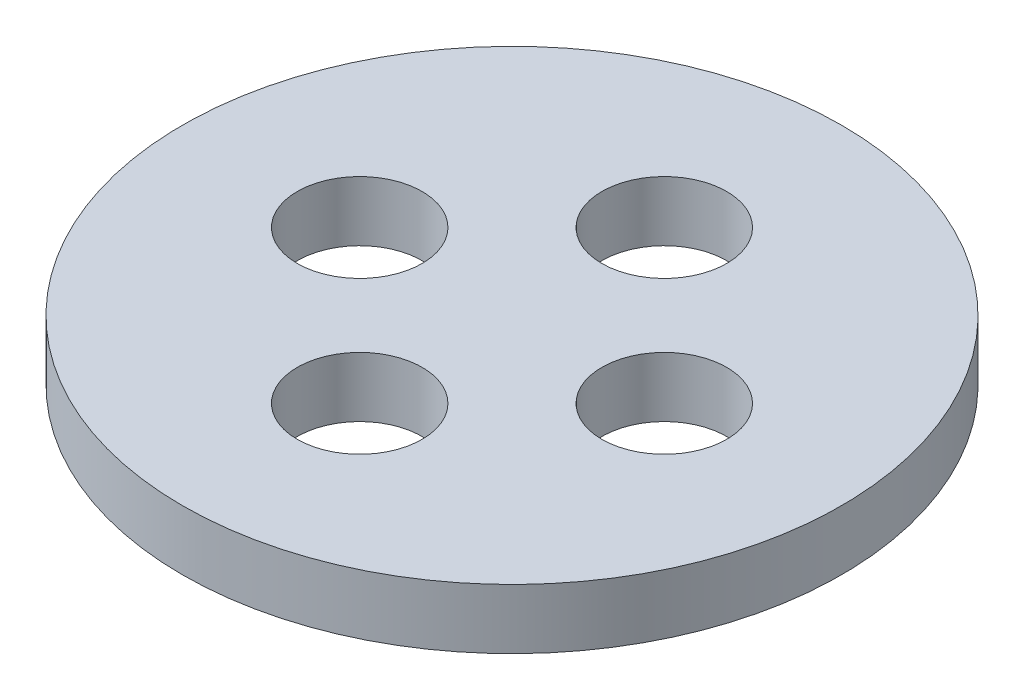
ISO-10303-21;
HEADER;
FILE_DESCRIPTION(('STEP AP214'),'2;1');
FILE_NAME('part.step','',(''),(''),'','','');
FILE_SCHEMA(('AUTOMOTIVE_DESIGN { 1 0 10303 214 1 1 1 1 }'));
ENDSEC;
DATA;
#1=APPLICATION_CONTEXT('core data for automotive mechanical design processes');
#2=APPLICATION_PROTOCOL_DEFINITION('international standard','automotive_design',2000,#1);
#3=PRODUCT_CONTEXT('',#1,'mechanical');
#4=PRODUCT('Part','Part','',(#3));
#5=PRODUCT_RELATED_PRODUCT_CATEGORY('part','',(#4));
#6=PRODUCT_DEFINITION_FORMATION('','',#4);
#7=PRODUCT_DEFINITION_CONTEXT('part definition',#1,'design');
#8=PRODUCT_DEFINITION('design','',#6,#7);
#9=PRODUCT_DEFINITION_SHAPE('','',#8);
#10=(LENGTH_UNIT() NAMED_UNIT(*) SI_UNIT(.MILLI.,.METRE.));
#11=(NAMED_UNIT(*) PLANE_ANGLE_UNIT() SI_UNIT($,.RADIAN.));
#12=(NAMED_UNIT(*) SI_UNIT($,.STERADIAN.) SOLID_ANGLE_UNIT());
#13=UNCERTAINTY_MEASURE_WITH_UNIT(LENGTH_MEASURE(1.E-05),#10,'distance_accuracy_value','');
#14=(GEOMETRIC_REPRESENTATION_CONTEXT(3) GLOBAL_UNCERTAINTY_ASSIGNED_CONTEXT((#13)) GLOBAL_UNIT_ASSIGNED_CONTEXT((#10,
#11,#12)) REPRESENTATION_CONTEXT('',''));
#15=CARTESIAN_POINT('',(0.,0.,0.));
#16=DIRECTION('',(0.,0.,1.));
#17=DIRECTION('',(1.,0.,0.));
#18=AXIS2_PLACEMENT_3D('',#15,#16,#17);
#19=CARTESIAN_POINT('',(0.,12.,0.));
#20=DIRECTION('',(0.,1.,0.));
#21=DIRECTION('',(0.,0.,1.));
#22=AXIS2_PLACEMENT_3D('',#19,#20,#21);
#23=PLANE('',#22);
#24=CARTESIAN_POINT('',(0.,12.,30.5));
#25=DIRECTION('',(0.,1.,0.));
#26=DIRECTION('',(0.,0.,1.));
#27=AXIS2_PLACEMENT_3D('',#24,#25,#26);
#28=CIRCLE('',#27,12.5);
#29=CARTESIAN_POINT('',(0.,12.,43.));
#30=VERTEX_POINT('',#29);
#31=EDGE_CURVE('E53',#30,#30,#28,.T.);
#32=ORIENTED_EDGE('',*,*,#31,.F.);
#33=EDGE_LOOP('',(#32));
#34=FACE_BOUND('',#33,.T.);
#35=CARTESIAN_POINT('',(0.,12.,-30.5));
#36=DIRECTION('',(0.,1.,0.));
#37=DIRECTION('',(0.,0.,1.));
#38=AXIS2_PLACEMENT_3D('',#35,#36,#37);
#39=CIRCLE('',#38,12.5);
#40=CARTESIAN_POINT('',(0.,12.,-18.));
#41=VERTEX_POINT('',#40);
#42=EDGE_CURVE('E42',#41,#41,#39,.T.);
#43=ORIENTED_EDGE('',*,*,#42,.F.);
#44=EDGE_LOOP('',(#43));
#45=FACE_BOUND('',#44,.T.);
#46=CARTESIAN_POINT('',(0.,12.,0.));
#47=DIRECTION('',(0.,1.,0.));
#48=DIRECTION('',(0.,0.,1.));
#49=AXIS2_PLACEMENT_3D('',#46,#47,#48);
#50=CIRCLE('',#49,66.);
#51=CARTESIAN_POINT('',(0.,12.,66.));
#52=VERTEX_POINT('',#51);
#53=EDGE_CURVE('E10',#52,#52,#50,.T.);
#54=ORIENTED_EDGE('',*,*,#53,.T.);
#55=EDGE_LOOP('',(#54));
#56=FACE_BOUND('',#55,.T.);
#57=CARTESIAN_POINT('',(30.5,12.,0.));
#58=DIRECTION('',(0.,1.,0.));
#59=DIRECTION('',(0.,0.,1.));
#60=AXIS2_PLACEMENT_3D('',#57,#58,#59);
#61=CIRCLE('',#60,12.5);
#62=CARTESIAN_POINT('',(30.5,12.,12.5));
#63=VERTEX_POINT('',#62);
#64=EDGE_CURVE('E47',#63,#63,#61,.T.);
#65=ORIENTED_EDGE('',*,*,#64,.F.);
#66=EDGE_LOOP('',(#65));
#67=FACE_BOUND('',#66,.T.);
#68=CARTESIAN_POINT('',(-30.5,12.,0.));
#69=DIRECTION('',(0.,1.,0.));
#70=DIRECTION('',(0.,0.,1.));
#71=AXIS2_PLACEMENT_3D('',#68,#69,#70);
#72=CIRCLE('',#71,12.5);
#73=CARTESIAN_POINT('',(-30.5,12.,12.5));
#74=VERTEX_POINT('',#73);
#75=EDGE_CURVE('E59',#74,#74,#72,.T.);
#76=ORIENTED_EDGE('',*,*,#75,.F.);
#77=EDGE_LOOP('',(#76));
#78=FACE_BOUND('',#77,.T.);
#79=ADVANCED_FACE('F31',(#34,#45,#56,#67,#78),#23,.T.);
#80=CARTESIAN_POINT('',(0.,0.,0.));
#81=DIRECTION('',(0.,1.,0.));
#82=DIRECTION('',(0.,0.,1.));
#83=AXIS2_PLACEMENT_3D('',#80,#81,#82);
#84=PLANE('',#83);
#85=CARTESIAN_POINT('',(0.,0.,30.5));
#86=DIRECTION('',(0.,1.,0.));
#87=DIRECTION('',(0.,0.,1.));
#88=AXIS2_PLACEMENT_3D('',#85,#86,#87);
#89=CIRCLE('',#88,12.5);
#90=CARTESIAN_POINT('',(0.,0.,43.));
#91=VERTEX_POINT('',#90);
#92=EDGE_CURVE('E56',#91,#91,#89,.T.);
#93=ORIENTED_EDGE('',*,*,#92,.T.);
#94=EDGE_LOOP('',(#93));
#95=FACE_BOUND('',#94,.T.);
#96=CARTESIAN_POINT('',(0.,0.,-30.5));
#97=DIRECTION('',(0.,1.,0.));
#98=DIRECTION('',(0.,0.,1.));
#99=AXIS2_PLACEMENT_3D('',#96,#97,#98);
#100=CIRCLE('',#99,12.5);
#101=CARTESIAN_POINT('',(0.,0.,-18.));
#102=VERTEX_POINT('',#101);
#103=EDGE_CURVE('E44',#102,#102,#100,.T.);
#104=ORIENTED_EDGE('',*,*,#103,.T.);
#105=EDGE_LOOP('',(#104));
#106=FACE_BOUND('',#105,.T.);
#107=CARTESIAN_POINT('',(0.,0.,0.));
#108=DIRECTION('',(0.,1.,0.));
#109=DIRECTION('',(0.,0.,1.));
#110=AXIS2_PLACEMENT_3D('',#107,#108,#109);
#111=CIRCLE('',#110,66.);
#112=CARTESIAN_POINT('',(0.,0.,66.));
#113=VERTEX_POINT('',#112);
#114=EDGE_CURVE('E35',#113,#113,#111,.T.);
#115=ORIENTED_EDGE('',*,*,#114,.F.);
#116=EDGE_LOOP('',(#115));
#117=FACE_BOUND('',#116,.T.);
#118=CARTESIAN_POINT('',(30.5,0.,0.));
#119=DIRECTION('',(0.,1.,0.));
#120=DIRECTION('',(0.,0.,1.));
#121=AXIS2_PLACEMENT_3D('',#118,#119,#120);
#122=CIRCLE('',#121,12.5);
#123=CARTESIAN_POINT('',(30.5,0.,12.5));
#124=VERTEX_POINT('',#123);
#125=EDGE_CURVE('E50',#124,#124,#122,.T.);
#126=ORIENTED_EDGE('',*,*,#125,.T.);
#127=EDGE_LOOP('',(#126));
#128=FACE_BOUND('',#127,.T.);
#129=CARTESIAN_POINT('',(-30.5,0.,0.));
#130=DIRECTION('',(0.,1.,0.));
#131=DIRECTION('',(0.,0.,1.));
#132=AXIS2_PLACEMENT_3D('',#129,#130,#131);
#133=CIRCLE('',#132,12.5);
#134=CARTESIAN_POINT('',(-30.5,0.,12.5));
#135=VERTEX_POINT('',#134);
#136=EDGE_CURVE('E62',#135,#135,#133,.T.);
#137=ORIENTED_EDGE('',*,*,#136,.T.);
#138=EDGE_LOOP('',(#137));
#139=FACE_BOUND('',#138,.T.);
#140=ADVANCED_FACE('F72',(#95,#106,#117,#128,#139),#84,.F.);
#141=CARTESIAN_POINT('',(0.,12.,0.));
#142=DIRECTION('',(0.,-1.,0.));
#143=DIRECTION('',(0.,0.,-1.));
#144=AXIS2_PLACEMENT_3D('',#141,#142,#143);
#145=CYLINDRICAL_SURFACE('',#144,66.);
#146=ORIENTED_EDGE('',*,*,#53,.F.);
#147=EDGE_LOOP('',(#146));
#148=FACE_BOUND('',#147,.T.);
#149=ORIENTED_EDGE('',*,*,#114,.T.);
#150=EDGE_LOOP('',(#149));
#151=FACE_BOUND('',#150,.T.);
#152=ADVANCED_FACE('F33',(#148,#151),#145,.T.);
#153=CARTESIAN_POINT('',(0.,12.,-30.5));
#154=DIRECTION('',(0.,-1.,0.));
#155=DIRECTION('',(0.,0.,-1.));
#156=AXIS2_PLACEMENT_3D('',#153,#154,#155);
#157=CYLINDRICAL_SURFACE('',#156,12.5);
#158=ORIENTED_EDGE('',*,*,#42,.T.);
#159=EDGE_LOOP('',(#158));
#160=FACE_BOUND('',#159,.T.);
#161=ORIENTED_EDGE('',*,*,#103,.F.);
#162=EDGE_LOOP('',(#161));
#163=FACE_BOUND('',#162,.T.);
#164=ADVANCED_FACE('F82',(#160,#163),#157,.F.);
#165=CARTESIAN_POINT('',(30.5,12.,0.));
#166=DIRECTION('',(0.,-1.,0.));
#167=DIRECTION('',(0.,0.,-1.));
#168=AXIS2_PLACEMENT_3D('',#165,#166,#167);
#169=CYLINDRICAL_SURFACE('',#168,12.5);
#170=ORIENTED_EDGE('',*,*,#64,.T.);
#171=EDGE_LOOP('',(#170));
#172=FACE_BOUND('',#171,.T.);
#173=ORIENTED_EDGE('',*,*,#125,.F.);
#174=EDGE_LOOP('',(#173));
#175=FACE_BOUND('',#174,.T.);
#176=ADVANCED_FACE('F85',(#172,#175),#169,.F.);
#177=CARTESIAN_POINT('',(0.,12.,30.5));
#178=DIRECTION('',(0.,-1.,0.));
#179=DIRECTION('',(0.,0.,-1.));
#180=AXIS2_PLACEMENT_3D('',#177,#178,#179);
#181=CYLINDRICAL_SURFACE('',#180,12.5);
#182=ORIENTED_EDGE('',*,*,#31,.T.);
#183=EDGE_LOOP('',(#182));
#184=FACE_BOUND('',#183,.T.);
#185=ORIENTED_EDGE('',*,*,#92,.F.);
#186=EDGE_LOOP('',(#185));
#187=FACE_BOUND('',#186,.T.);
#188=ADVANCED_FACE('F89',(#184,#187),#181,.F.);
#189=CARTESIAN_POINT('',(-30.5,12.,0.));
#190=DIRECTION('',(0.,-1.,0.));
#191=DIRECTION('',(0.,0.,-1.));
#192=AXIS2_PLACEMENT_3D('',#189,#190,#191);
#193=CYLINDRICAL_SURFACE('',#192,12.5);
#194=ORIENTED_EDGE('',*,*,#75,.T.);
#195=EDGE_LOOP('',(#194));
#196=FACE_BOUND('',#195,.T.);
#197=ORIENTED_EDGE('',*,*,#136,.F.);
#198=EDGE_LOOP('',(#197));
#199=FACE_BOUND('',#198,.T.);
#200=ADVANCED_FACE('F68',(#196,#199),#193,.F.);
#201=CLOSED_SHELL('',(#79,#140,#152,#164,#176,#188,#200));
#202=MANIFOLD_SOLID_BREP('B2',#201);
#203=ADVANCED_BREP_SHAPE_REPRESENTATION('',(#18,#202),#14);
#204=SHAPE_DEFINITION_REPRESENTATION(#9,#203);
ENDSEC;
END-ISO-10303-21;
